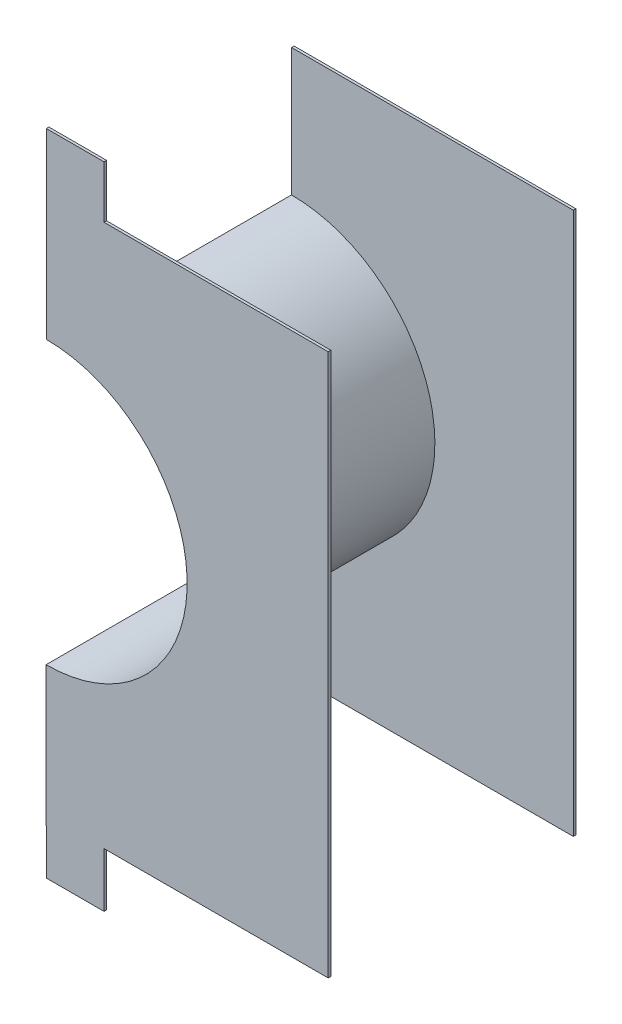
ISO-10303-21;
HEADER;
FILE_DESCRIPTION(('STEP AP214'),'2;1');
FILE_NAME('part.step','',(''),(''),'','','');
FILE_SCHEMA(('AUTOMOTIVE_DESIGN { 1 0 10303 214 1 1 1 1 }'));
ENDSEC;
DATA;
#1=APPLICATION_CONTEXT('core data for automotive mechanical design processes');
#2=APPLICATION_PROTOCOL_DEFINITION('international standard','automotive_design',2000,#1);
#3=PRODUCT_CONTEXT('',#1,'mechanical');
#4=PRODUCT('Part','Part','',(#3));
#5=PRODUCT_RELATED_PRODUCT_CATEGORY('part','',(#4));
#6=PRODUCT_DEFINITION_FORMATION('','',#4);
#7=PRODUCT_DEFINITION_CONTEXT('part definition',#1,'design');
#8=PRODUCT_DEFINITION('design','',#6,#7);
#9=PRODUCT_DEFINITION_SHAPE('','',#8);
#10=(LENGTH_UNIT() NAMED_UNIT(*) SI_UNIT(.MILLI.,.METRE.));
#11=(NAMED_UNIT(*) PLANE_ANGLE_UNIT() SI_UNIT($,.RADIAN.));
#12=(NAMED_UNIT(*) SI_UNIT($,.STERADIAN.) SOLID_ANGLE_UNIT());
#13=UNCERTAINTY_MEASURE_WITH_UNIT(LENGTH_MEASURE(1.E-05),#10,'distance_accuracy_value','');
#14=(GEOMETRIC_REPRESENTATION_CONTEXT(3) GLOBAL_UNCERTAINTY_ASSIGNED_CONTEXT((#13)) GLOBAL_UNIT_ASSIGNED_CONTEXT((#10,
#11,#12)) REPRESENTATION_CONTEXT('',''));
#15=CARTESIAN_POINT('',(0.,0.,0.));
#16=DIRECTION('',(0.,0.,1.));
#17=DIRECTION('',(1.,0.,0.));
#18=AXIS2_PLACEMENT_3D('',#15,#16,#17);
#19=CARTESIAN_POINT('',(0.330340345843,-0.760783826789,0.));
#20=DIRECTION('',(-1.,0.,0.));
#21=DIRECTION('',(0.,0.,1.));
#22=AXIS2_PLACEMENT_3D('',#19,#20,#21);
#23=PLANE('',#22);
#24=DIRECTION('',(0.,1.,0.));
#25=VECTOR('',#24,1.);
#26=CARTESIAN_POINT('',(0.330340345843,-0.001069787476899,-0.574));
#27=LINE('',#26,#25);
#28=CARTESIAN_POINT('',(0.330340345843,-0.635,-0.574));
#29=VERTEX_POINT('',#28);
#30=CARTESIAN_POINT('',(0.330340345843,0.635,-0.574));
#31=VERTEX_POINT('',#30);
#32=EDGE_CURVE('E295',#29,#31,#27,.T.);
#33=ORIENTED_EDGE('',*,*,#32,.F.);
#34=DIRECTION('',(0.,0.,1.));
#35=VECTOR('',#34,1.);
#36=CARTESIAN_POINT('',(0.330340345843,-0.635,-0.58));
#37=LINE('',#36,#35);
#38=CARTESIAN_POINT('',(0.330340345843,-0.635,-0.58));
#39=VERTEX_POINT('',#38);
#40=EDGE_CURVE('E412',#29,#39,#37,.F.);
#41=ORIENTED_EDGE('',*,*,#40,.T.);
#42=DIRECTION('',(0.,1.,0.));
#43=VECTOR('',#42,1.);
#44=CARTESIAN_POINT('',(0.330340345843,-0.001069787476899,-0.58));
#45=LINE('',#44,#43);
#46=CARTESIAN_POINT('',(0.330340345843,0.635,-0.58));
#47=VERTEX_POINT('',#46);
#48=EDGE_CURVE('E397',#39,#47,#45,.T.);
#49=ORIENTED_EDGE('',*,*,#48,.T.);
#50=DIRECTION('',(0.,0.,-1.));
#51=VECTOR('',#50,1.);
#52=CARTESIAN_POINT('',(0.330340345843,0.635,-0.58));
#53=LINE('',#52,#51);
#54=EDGE_CURVE('E419',#47,#31,#53,.F.);
#55=ORIENTED_EDGE('',*,*,#54,.T.);
#56=EDGE_LOOP('',(#33,#41,#49,#55));
#57=FACE_BOUND('',#56,.T.);
#58=ADVANCED_FACE('F17',(#57),#23,.F.);
#59=CARTESIAN_POINT('',(-0.330340345843,0.635,-0.58));
#60=DIRECTION('',(0.,-1.,0.));
#61=DIRECTION('',(0.,0.,-1.));
#62=AXIS2_PLACEMENT_3D('',#59,#60,#61);
#63=PLANE('',#62);
#64=DIRECTION('',(1.,0.,0.));
#65=VECTOR('',#64,1.);
#66=CARTESIAN_POINT('',(0.02781893329865,0.635,-0.574));
#67=LINE('',#66,#65);
#68=CARTESIAN_POINT('',(-0.329659654157,0.635,-0.574));
#69=VERTEX_POINT('',#68);
#70=EDGE_CURVE('E392',#31,#69,#67,.F.);
#71=ORIENTED_EDGE('',*,*,#70,.F.);
#72=ORIENTED_EDGE('',*,*,#54,.F.);
#73=DIRECTION('',(1.,0.,0.));
#74=VECTOR('',#73,1.);
#75=CARTESIAN_POINT('',(0.02781893329865,0.635,-0.58));
#76=LINE('',#75,#74);
#77=CARTESIAN_POINT('',(-0.329659654157,0.635,-0.58));
#78=VERTEX_POINT('',#77);
#79=EDGE_CURVE('E393',#47,#78,#76,.F.);
#80=ORIENTED_EDGE('',*,*,#79,.T.);
#81=DIRECTION('',(0.,0.,-1.));
#82=VECTOR('',#81,1.);
#83=CARTESIAN_POINT('',(-0.329659654157,0.635,0.));
#84=LINE('',#83,#82);
#85=EDGE_CURVE('E444',#78,#69,#84,.F.);
#86=ORIENTED_EDGE('',*,*,#85,.T.);
#87=EDGE_LOOP('',(#71,#72,#80,#86));
#88=FACE_BOUND('',#87,.T.);
#89=ADVANCED_FACE('F324',(#88),#63,.F.);
#90=CARTESIAN_POINT('',(0.330340345843,-0.635,-0.58));
#91=DIRECTION('',(0.,1.,0.));
#92=DIRECTION('',(0.,0.,1.));
#93=AXIS2_PLACEMENT_3D('',#90,#91,#92);
#94=PLANE('',#93);
#95=DIRECTION('',(0.,0.,-1.));
#96=VECTOR('',#95,1.);
#97=CARTESIAN_POINT('',(-0.330340345843,-0.635,-0.58));
#98=LINE('',#97,#96);
#99=CARTESIAN_POINT('',(-0.330340345843,-0.635,-0.574));
#100=VERTEX_POINT('',#99);
#101=CARTESIAN_POINT('',(-0.330340345843,-0.635,-0.58));
#102=VERTEX_POINT('',#101);
#103=EDGE_CURVE('E193',#100,#102,#98,.T.);
#104=ORIENTED_EDGE('',*,*,#103,.T.);
#105=DIRECTION('',(1.,0.,0.));
#106=VECTOR('',#105,1.);
#107=CARTESIAN_POINT('',(0.02781893329865,-0.635,-0.58));
#108=LINE('',#107,#106);
#109=EDGE_CURVE('E311',#102,#39,#108,.T.);
#110=ORIENTED_EDGE('',*,*,#109,.T.);
#111=ORIENTED_EDGE('',*,*,#40,.F.);
#112=DIRECTION('',(1.,0.,0.));
#113=VECTOR('',#112,1.);
#114=CARTESIAN_POINT('',(0.02781893329865,-0.635,-0.574));
#115=LINE('',#114,#113);
#116=EDGE_CURVE('E292',#100,#29,#115,.T.);
#117=ORIENTED_EDGE('',*,*,#116,.F.);
#118=EDGE_LOOP('',(#104,#110,#111,#117));
#119=FACE_BOUND('',#118,.T.);
#120=ADVANCED_FACE('F322',(#119),#94,.F.);
#121=CARTESIAN_POINT('',(0.02781893329865,-0.001069787476899,-0.58));
#122=DIRECTION('',(0.,0.,1.));
#123=DIRECTION('',(1.,0.,0.));
#124=AXIS2_PLACEMENT_3D('',#121,#122,#123);
#125=PLANE('',#124);
#126=ORIENTED_EDGE('',*,*,#48,.F.);
#127=ORIENTED_EDGE('',*,*,#109,.F.);
#128=DIRECTION('',(0.,1.,0.));
#129=VECTOR('',#128,1.);
#130=CARTESIAN_POINT('',(-0.330340345843,-0.635,-0.58));
#131=LINE('',#130,#129);
#132=CARTESIAN_POINT('',(-0.330340345843,-0.329999824491983,-0.58));
#133=VERTEX_POINT('',#132);
#134=EDGE_CURVE('E151',#102,#133,#131,.T.);
#135=ORIENTED_EDGE('',*,*,#134,.T.);
#136=CARTESIAN_POINT('',(-0.330340345843,-0.329999824492,-0.58));
#137=CARTESIAN_POINT('',(-0.26712841051764,-0.33006501822186,-0.58));
#138=CARTESIAN_POINT('',(-0.208845260031309,-0.306955255669527,-0.58));
#139=CARTESIAN_POINT('',(-0.144821469592758,-0.281569280779884,-0.58));
#140=CARTESIAN_POINT('',(-0.0968955471649169,-0.23358577454217,-0.58));
#141=CARTESIAN_POINT('',(-0.0482248819428217,-0.184856630689084,-0.58));
#142=CARTESIAN_POINT('',(-0.0232953033389743,-0.121787639134969,-0.58));
#143=CARTESIAN_POINT('',(3.58282880240539E-05,-0.062762536187419,-0.58));
#144=CARTESIAN_POINT('',(-1.75508066142371E-07,-0.000340345842999733,-0.58));
#145=CARTESIAN_POINT('',(-3.67828967418281E-05,0.0631283333540779,-0.58));
#146=CARTESIAN_POINT('',(-0.0230447443305151,0.121154739968696,-0.58));
#147=CARTESIAN_POINT('',(-0.0484307192201517,0.185178530407263,-0.58));
#148=CARTESIAN_POINT('',(-0.0964142254578492,0.233104452835103,-0.58));
#149=CARTESIAN_POINT('',(-0.145143369310935,0.281775118057213,-0.58));
#150=CARTESIAN_POINT('',(-0.208212360865036,0.306704696661068,-0.58));
#151=CARTESIAN_POINT('',(-0.266982841853826,0.329935182662093,-0.58));
#152=CARTESIAN_POINT('',(-0.329659654157,0.329999824492,-0.58));
#153=B_SPLINE_CURVE_WITH_KNOTS('',2,(#136,#137,#138,#139,#140,#141,#142,#143,#144,#145,#146,
#147,#148,#149,#150,#151,#152),.UNSPECIFIED.,.F.,.F.,(3,2,2,2,2,2,2,2,3),(0.,0.125,0.25,0.375,
0.5,0.625,0.75,0.875,1.),.UNSPECIFIED.);
#154=CARTESIAN_POINT('',(-0.329659654157,0.32999982449195,-0.58));
#155=VERTEX_POINT('',#154);
#156=EDGE_CURVE('E146',#133,#155,#153,.T.);
#157=ORIENTED_EDGE('',*,*,#156,.T.);
#158=DIRECTION('',(0.,1.,0.));
#159=VECTOR('',#158,1.);
#160=CARTESIAN_POINT('',(-0.329659654157,0.759216173211,-0.58));
#161=LINE('',#160,#159);
#162=EDGE_CURVE('E198',#155,#78,#161,.T.);
#163=ORIENTED_EDGE('',*,*,#162,.T.);
#164=ORIENTED_EDGE('',*,*,#79,.F.);
#165=EDGE_LOOP('',(#126,#127,#135,#157,#163,#164));
#166=FACE_BOUND('',#165,.T.);
#167=ADVANCED_FACE('F313',(#166),#125,.F.);
#168=CARTESIAN_POINT('',(-0.33,0.,0.));
#169=DIRECTION('',(0.,0.,1.));
#170=DIRECTION('',(1.,0.,0.));
#171=AXIS2_PLACEMENT_3D('',#168,#169,#170);
#172=CYLINDRICAL_SURFACE('',#171,0.336);
#173=DIRECTION('',(0.,0.,-1.));
#174=VECTOR('',#173,1.);
#175=CARTESIAN_POINT('',(-0.329659654157,0.335999827664,0.));
#176=LINE('',#175,#174);
#177=CARTESIAN_POINT('',(-0.32965965415701,0.335999827649753,-0.574));
#178=VERTEX_POINT('',#177);
#179=CARTESIAN_POINT('',(-0.32965965415701,0.335999827654502,-0.006));
#180=VERTEX_POINT('',#179);
#181=EDGE_CURVE('E447',#178,#180,#176,.F.);
#182=ORIENTED_EDGE('',*,*,#181,.T.);
#183=CARTESIAN_POINT('',(-0.33,0.,-0.006));
#184=DIRECTION('',(0.,0.,-1.));
#185=DIRECTION('',(0.00101293405643372,0.999999486982167,0.));
#186=AXIS2_PLACEMENT_3D('',#183,#184,#185);
#187=CIRCLE('',#186,0.336);
#188=CARTESIAN_POINT('',(-0.330340345843,-0.335999827626002,-0.00600000000000002));
#189=VERTEX_POINT('',#188);
#190=EDGE_CURVE('E232',#180,#189,#187,.T.);
#191=ORIENTED_EDGE('',*,*,#190,.T.);
#192=DIRECTION('',(0.,0.,-1.));
#193=VECTOR('',#192,1.);
#194=CARTESIAN_POINT('',(-0.330340345843,-0.335999827626,-0.58));
#195=LINE('',#194,#193);
#196=CARTESIAN_POINT('',(-0.330340345843,-0.335999827626002,-0.574));
#197=VERTEX_POINT('',#196);
#198=EDGE_CURVE('E278',#189,#197,#195,.T.);
#199=ORIENTED_EDGE('',*,*,#198,.T.);
#200=CARTESIAN_POINT('',(-0.329659654157,0.335999827664,-0.574));
#201=CARTESIAN_POINT('',(-0.26583836238212,0.335935180863654,-0.574));
#202=CARTESIAN_POINT('',(-0.206003791454036,0.312283429405446,-0.574));
#203=CARTESIAN_POINT('',(-0.141779403355028,0.286896445905572,-0.574));
#204=CARTESIAN_POINT('',(-0.0921715825546136,0.237347095749475,-0.574));
#205=CARTESIAN_POINT('',(-0.0433093913833842,0.188542496380394,-0.574));
#206=CARTESIAN_POINT('',(-0.0174660116101208,0.123363309382388,-0.574));
#207=CARTESIAN_POINT('',(0.00596322683989083,0.0642727907446489,-0.574));
#208=CARTESIAN_POINT('',(0.00599982762600817,-0.000340345842980596,-0.574));
#209=CARTESIAN_POINT('',(0.00603583562097266,-0.0639069995598871,-0.574));
#210=CARTESIAN_POINT('',(-0.0177165706185686,-0.123996208545957,-0.574));
#211=CARTESIAN_POINT('',(-0.0431035541111863,-0.188220596644974,-0.574));
#212=CARTESIAN_POINT('',(-0.0926529042616657,-0.237828417445386,-0.574));
#213=CARTESIAN_POINT('',(-0.141457503625223,-0.286690608616623,-0.574));
#214=CARTESIAN_POINT('',(-0.206636690620298,-0.312533988389879,-0.574));
#215=CARTESIAN_POINT('',(-0.265983931285183,-0.336065016463508,-0.574));
#216=CARTESIAN_POINT('',(-0.330340345843,-0.335999827626,-0.574));
#217=B_SPLINE_CURVE_WITH_KNOTS('',2,(#200,#201,#202,#203,#204,#205,#206,#207,#208,#209,#210,
#211,#212,#213,#214,#215,#216),.UNSPECIFIED.,.F.,.F.,(3,2,2,2,2,2,2,2,3),(0.,0.125,0.25,0.375,
0.5,0.625,0.75,0.875,1.),.UNSPECIFIED.);
#218=EDGE_CURVE('E296',#178,#197,#217,.T.);
#219=ORIENTED_EDGE('',*,*,#218,.F.);
#220=EDGE_LOOP('',(#182,#191,#199,#219));
#221=FACE_BOUND('',#220,.T.);
#222=ADVANCED_FACE('F267',(#221),#172,.T.);
#223=CARTESIAN_POINT('',(0.02781893329865,-0.001069787476899,-0.574));
#224=DIRECTION('',(0.,0.,1.));
#225=DIRECTION('',(1.,0.,0.));
#226=AXIS2_PLACEMENT_3D('',#223,#224,#225);
#227=PLANE('',#226);
#228=ORIENTED_EDGE('',*,*,#116,.T.);
#229=ORIENTED_EDGE('',*,*,#32,.T.);
#230=ORIENTED_EDGE('',*,*,#70,.T.);
#231=DIRECTION('',(0.,1.,0.));
#232=VECTOR('',#231,1.);
#233=CARTESIAN_POINT('',(-0.329659654157,0.759216173211,-0.574));
#234=LINE('',#233,#232);
#235=EDGE_CURVE('E390',#69,#178,#234,.F.);
#236=ORIENTED_EDGE('',*,*,#235,.T.);
#237=ORIENTED_EDGE('',*,*,#218,.T.);
#238=DIRECTION('',(0.,1.,0.));
#239=VECTOR('',#238,1.);
#240=CARTESIAN_POINT('',(-0.330340345843,-0.635,-0.574));
#241=LINE('',#240,#239);
#242=EDGE_CURVE('E285',#197,#100,#241,.F.);
#243=ORIENTED_EDGE('',*,*,#242,.T.);
#244=EDGE_LOOP('',(#228,#229,#230,#236,#237,#243));
#245=FACE_BOUND('',#244,.T.);
#246=ADVANCED_FACE('F262',(#245),#227,.T.);
#247=CARTESIAN_POINT('',(0.02781893329865,-0.001069787476899,-0.006));
#248=DIRECTION('',(0.,0.,1.));
#249=DIRECTION('',(1.,0.,0.));
#250=AXIS2_PLACEMENT_3D('',#247,#248,#249);
#251=PLANE('',#250);
#252=DIRECTION('',(0.,1.,0.));
#253=VECTOR('',#252,1.);
#254=CARTESIAN_POINT('',(0.330340345843,-0.760783826789,-0.006));
#255=LINE('',#254,#253);
#256=CARTESIAN_POINT('',(0.330340345843,0.635,-0.00600000000000001));
#257=VERTEX_POINT('',#256);
#258=CARTESIAN_POINT('',(0.330340345843,-0.635,-0.00600000000000001));
#259=VERTEX_POINT('',#258);
#260=EDGE_CURVE('E235',#257,#259,#255,.F.);
#261=ORIENTED_EDGE('',*,*,#260,.T.);
#262=DIRECTION('',(1.,0.,0.));
#263=VECTOR('',#262,1.);
#264=CARTESIAN_POINT('',(0.330340345843,-0.635,-0.00600000000000004));
#265=LINE('',#264,#263);
#266=CARTESIAN_POINT('',(-0.194599178732,-0.635,-0.00600000000000002));
#267=VERTEX_POINT('',#266);
#268=EDGE_CURVE('E249',#259,#267,#265,.F.);
#269=ORIENTED_EDGE('',*,*,#268,.T.);
#270=DIRECTION('',(0.,1.,0.));
#271=VECTOR('',#270,1.);
#272=CARTESIAN_POINT('',(-0.194599178732,-0.762439620436,-0.006));
#273=LINE('',#272,#271);
#274=CARTESIAN_POINT('',(-0.194599178732,-0.762439620436,-0.006));
#275=VERTEX_POINT('',#274);
#276=EDGE_CURVE('E497',#267,#275,#273,.F.);
#277=ORIENTED_EDGE('',*,*,#276,.T.);
#278=DIRECTION('',(1.,0.,0.));
#279=VECTOR('',#278,1.);
#280=CARTESIAN_POINT('',(-0.329659654157,-0.762439620436,-0.006));
#281=LINE('',#280,#279);
#282=CARTESIAN_POINT('',(-0.329659654157,-0.762439620436,-0.006));
#283=VERTEX_POINT('',#282);
#284=EDGE_CURVE('E186',#275,#283,#281,.F.);
#285=ORIENTED_EDGE('',*,*,#284,.T.);
#286=DIRECTION('',(0.,1.,0.));
#287=VECTOR('',#286,1.);
#288=CARTESIAN_POINT('',(-0.329659654157,-0.635,-0.006));
#289=LINE('',#288,#287);
#290=CARTESIAN_POINT('',(-0.33,-0.635,-0.00600000000000002));
#291=VERTEX_POINT('',#290);
#292=EDGE_CURVE('E187',#283,#291,#289,.T.);
#293=ORIENTED_EDGE('',*,*,#292,.T.);
#294=DIRECTION('',(0.,1.,0.));
#295=VECTOR('',#294,1.);
#296=CARTESIAN_POINT('',(-0.330340345843,-0.635,-0.00600000000000004));
#297=LINE('',#296,#295);
#298=EDGE_CURVE('E150',#291,#189,#297,.T.);
#299=ORIENTED_EDGE('',*,*,#298,.T.);
#300=ORIENTED_EDGE('',*,*,#190,.F.);
#301=DIRECTION('',(0.,1.,0.));
#302=VECTOR('',#301,1.);
#303=CARTESIAN_POINT('',(-0.329659654157,0.759216173211,-0.006));
#304=LINE('',#303,#302);
#305=CARTESIAN_POINT('',(-0.329659654157,0.757662112361,-0.006));
#306=VERTEX_POINT('',#305);
#307=EDGE_CURVE('E199',#180,#306,#304,.T.);
#308=ORIENTED_EDGE('',*,*,#307,.T.);
#309=DIRECTION('',(1.,0.,0.));
#310=VECTOR('',#309,1.);
#311=CARTESIAN_POINT('',(-0.194599178732,0.757662112361,-0.006));
#312=LINE('',#311,#310);
#313=CARTESIAN_POINT('',(-0.194599178732,0.757662112361,-0.006));
#314=VERTEX_POINT('',#313);
#315=EDGE_CURVE('E206',#306,#314,#312,.T.);
#316=ORIENTED_EDGE('',*,*,#315,.T.);
#317=DIRECTION('',(0.,1.,0.));
#318=VECTOR('',#317,1.);
#319=CARTESIAN_POINT('',(-0.194599178732,0.635,-0.006));
#320=LINE('',#319,#318);
#321=CARTESIAN_POINT('',(-0.194599178732,0.635,-0.00600000000000001));
#322=VERTEX_POINT('',#321);
#323=EDGE_CURVE('E207',#314,#322,#320,.F.);
#324=ORIENTED_EDGE('',*,*,#323,.T.);
#325=DIRECTION('',(1.,0.,0.));
#326=VECTOR('',#325,1.);
#327=CARTESIAN_POINT('',(-0.330340345843,0.635,-0.00600000000000004));
#328=LINE('',#327,#326);
#329=EDGE_CURVE('E217',#322,#257,#328,.T.);
#330=ORIENTED_EDGE('',*,*,#329,.T.);
#331=EDGE_LOOP('',(#261,#269,#277,#285,#293,#299,#300,#308,#316,#324,#330));
#332=FACE_BOUND('',#331,.T.);
#333=ADVANCED_FACE('F251',(#332),#251,.F.);
#334=CARTESIAN_POINT('',(-0.330340345843,0.635,-0.58));
#335=DIRECTION('',(0.,-1.,0.));
#336=DIRECTION('',(0.,0.,-1.));
#337=AXIS2_PLACEMENT_3D('',#334,#335,#336);
#338=PLANE('',#337);
#339=DIRECTION('',(1.,0.,0.));
#340=VECTOR('',#339,1.);
#341=CARTESIAN_POINT('',(0.02781893329865,0.635,0.));
#342=LINE('',#341,#340);
#343=CARTESIAN_POINT('',(0.330340345843,0.635,0.));
#344=VERTEX_POINT('',#343);
#345=CARTESIAN_POINT('',(-0.194599178732,0.635,0.));
#346=VERTEX_POINT('',#345);
#347=EDGE_CURVE('E212',#344,#346,#342,.F.);
#348=ORIENTED_EDGE('',*,*,#347,.F.);
#349=DIRECTION('',(0.,0.,1.));
#350=VECTOR('',#349,1.);
#351=CARTESIAN_POINT('',(0.330340345843,0.635,0.));
#352=LINE('',#351,#350);
#353=EDGE_CURVE('E222',#344,#257,#352,.F.);
#354=ORIENTED_EDGE('',*,*,#353,.T.);
#355=ORIENTED_EDGE('',*,*,#329,.F.);
#356=DIRECTION('',(0.,0.,1.));
#357=VECTOR('',#356,1.);
#358=CARTESIAN_POINT('',(-0.194599178732,0.635,0.));
#359=LINE('',#358,#357);
#360=EDGE_CURVE('E215',#322,#346,#359,.T.);
#361=ORIENTED_EDGE('',*,*,#360,.T.);
#362=EDGE_LOOP('',(#348,#354,#355,#361));
#363=FACE_BOUND('',#362,.T.);
#364=ADVANCED_FACE('F261',(#363),#338,.F.);
#365=CARTESIAN_POINT('',(-0.194599178732,0.635,0.));
#366=DIRECTION('',(-1.,0.,0.));
#367=DIRECTION('',(0.,0.,1.));
#368=AXIS2_PLACEMENT_3D('',#365,#366,#367);
#369=PLANE('',#368);
#370=DIRECTION('',(0.,0.,-1.));
#371=VECTOR('',#370,1.);
#372=CARTESIAN_POINT('',(-0.194599178732,0.757662112361,0.));
#373=LINE('',#372,#371);
#374=CARTESIAN_POINT('',(-0.194599178732,0.757662112361,0.));
#375=VERTEX_POINT('',#374);
#376=EDGE_CURVE('E204',#314,#375,#373,.F.);
#377=ORIENTED_EDGE('',*,*,#376,.T.);
#378=DIRECTION('',(0.,1.,0.));
#379=VECTOR('',#378,1.);
#380=CARTESIAN_POINT('',(-0.194599178732,-0.001069787476899,0.));
#381=LINE('',#380,#379);
#382=EDGE_CURVE('E171',#346,#375,#381,.T.);
#383=ORIENTED_EDGE('',*,*,#382,.F.);
#384=ORIENTED_EDGE('',*,*,#360,.F.);
#385=ORIENTED_EDGE('',*,*,#323,.F.);
#386=EDGE_LOOP('',(#377,#383,#384,#385));
#387=FACE_BOUND('',#386,.T.);
#388=ADVANCED_FACE('F478',(#387),#369,.F.);
#389=CARTESIAN_POINT('',(-0.194599178732,0.757662112361,0.));
#390=DIRECTION('',(0.,-1.,0.));
#391=DIRECTION('',(0.,0.,-1.));
#392=AXIS2_PLACEMENT_3D('',#389,#390,#391);
#393=PLANE('',#392);
#394=DIRECTION('',(0.,0.,-1.));
#395=VECTOR('',#394,1.);
#396=CARTESIAN_POINT('',(-0.329659654157,0.757662112361,0.));
#397=LINE('',#396,#395);
#398=CARTESIAN_POINT('',(-0.329659654157,0.757662112361,0.));
#399=VERTEX_POINT('',#398);
#400=EDGE_CURVE('E196',#306,#399,#397,.F.);
#401=ORIENTED_EDGE('',*,*,#400,.T.);
#402=DIRECTION('',(1.,0.,0.));
#403=VECTOR('',#402,1.);
#404=CARTESIAN_POINT('',(0.02781893329865,0.757662112361,0.));
#405=LINE('',#404,#403);
#406=EDGE_CURVE('E169',#375,#399,#405,.F.);
#407=ORIENTED_EDGE('',*,*,#406,.F.);
#408=ORIENTED_EDGE('',*,*,#376,.F.);
#409=ORIENTED_EDGE('',*,*,#315,.F.);
#410=EDGE_LOOP('',(#401,#407,#408,#409));
#411=FACE_BOUND('',#410,.T.);
#412=ADVANCED_FACE('F476',(#411),#393,.F.);
#413=CARTESIAN_POINT('',(-0.329659654157,0.759216173211,0.));
#414=DIRECTION('',(1.,0.,0.));
#415=DIRECTION('',(0.,0.,-1.));
#416=AXIS2_PLACEMENT_3D('',#413,#414,#415);
#417=PLANE('',#416);
#418=ORIENTED_EDGE('',*,*,#162,.F.);
#419=DIRECTION('',(0.,0.,1.));
#420=VECTOR('',#419,1.);
#421=CARTESIAN_POINT('',(-0.329659654157,0.329999824491934,0.));
#422=LINE('',#421,#420);
#423=CARTESIAN_POINT('',(-0.329659654157,0.329999824491934,0.));
#424=VERTEX_POINT('',#423);
#425=EDGE_CURVE('E135',#155,#424,#422,.T.);
#426=ORIENTED_EDGE('',*,*,#425,.T.);
#427=DIRECTION('',(0.,1.,0.));
#428=VECTOR('',#427,1.);
#429=CARTESIAN_POINT('',(-0.329659654157,-0.001069787476899,0.));
#430=LINE('',#429,#428);
#431=EDGE_CURVE('E168',#399,#424,#430,.F.);
#432=ORIENTED_EDGE('',*,*,#431,.F.);
#433=ORIENTED_EDGE('',*,*,#400,.F.);
#434=ORIENTED_EDGE('',*,*,#307,.F.);
#435=ORIENTED_EDGE('',*,*,#181,.F.);
#436=ORIENTED_EDGE('',*,*,#235,.F.);
#437=ORIENTED_EDGE('',*,*,#85,.F.);
#438=EDGE_LOOP('',(#418,#426,#432,#433,#434,#435,#436,#437));
#439=FACE_BOUND('',#438,.T.);
#440=ADVANCED_FACE('F446',(#439),#417,.F.);
#441=CARTESIAN_POINT('',(-0.33,0.,0.));
#442=DIRECTION('',(0.,0.,1.));
#443=DIRECTION('',(1.,0.,0.));
#444=AXIS2_PLACEMENT_3D('',#441,#442,#443);
#445=CYLINDRICAL_SURFACE('',#444,0.33);
#446=CARTESIAN_POINT('',(-0.33,0.,0.));
#447=DIRECTION('',(0.,0.,1.));
#448=DIRECTION('',(1.,0.,0.));
#449=AXIS2_PLACEMENT_3D('',#446,#447,#448);
#450=CIRCLE('',#449,0.33);
#451=CARTESIAN_POINT('',(-0.330340345843,-0.329999824491967,0.));
#452=VERTEX_POINT('',#451);
#453=EDGE_CURVE('E20',#424,#452,#450,.F.);
#454=ORIENTED_EDGE('',*,*,#453,.F.);
#455=ORIENTED_EDGE('',*,*,#425,.F.);
#456=ORIENTED_EDGE('',*,*,#156,.F.);
#457=DIRECTION('',(0.,0.,-1.));
#458=VECTOR('',#457,1.);
#459=CARTESIAN_POINT('',(-0.330340345843,-0.329999824492,-0.58));
#460=LINE('',#459,#458);
#461=EDGE_CURVE('E141',#133,#452,#460,.F.);
#462=ORIENTED_EDGE('',*,*,#461,.T.);
#463=EDGE_LOOP('',(#454,#455,#456,#462));
#464=FACE_BOUND('',#463,.T.);
#465=ADVANCED_FACE('F143',(#464),#445,.F.);
#466=CARTESIAN_POINT('',(-0.330340345843,-0.635,-0.58));
#467=DIRECTION('',(1.,0.,0.));
#468=DIRECTION('',(0.,0.,-1.));
#469=AXIS2_PLACEMENT_3D('',#466,#467,#468);
#470=PLANE('',#469);
#471=ORIENTED_EDGE('',*,*,#198,.F.);
#472=ORIENTED_EDGE('',*,*,#298,.F.);
#473=CARTESIAN_POINT('',(-0.330340345843,-0.635,-0.00600000000000004));
#474=DIRECTION('',(0.,0.,1.));
#475=VECTOR('',#474,1.);
#476=LINE('',#473,#475);
#477=CARTESIAN_POINT('',(-0.33,-0.635,0.));
#478=VERTEX_POINT('',#477);
#479=EDGE_CURVE('E158',#291,#478,#476,.T.);
#480=ORIENTED_EDGE('',*,*,#479,.T.);
#481=DIRECTION('',(0.,1.,0.));
#482=VECTOR('',#481,1.);
#483=CARTESIAN_POINT('',(-0.330340345843,-0.001069787476899,0.));
#484=LINE('',#483,#482);
#485=EDGE_CURVE('E154',#452,#478,#484,.F.);
#486=ORIENTED_EDGE('',*,*,#485,.F.);
#487=ORIENTED_EDGE('',*,*,#461,.F.);
#488=ORIENTED_EDGE('',*,*,#134,.F.);
#489=ORIENTED_EDGE('',*,*,#103,.F.);
#490=ORIENTED_EDGE('',*,*,#242,.F.);
#491=EDGE_LOOP('',(#471,#472,#480,#486,#487,#488,#489,#490));
#492=FACE_BOUND('',#491,.T.);
#493=ADVANCED_FACE('F156',(#492),#470,.F.);
#494=CARTESIAN_POINT('',(-0.329659654157,-0.635,0.));
#495=DIRECTION('',(1.,0.,0.));
#496=DIRECTION('',(0.,0.,-1.));
#497=AXIS2_PLACEMENT_3D('',#494,#495,#496);
#498=PLANE('',#497);
#499=DIRECTION('',(0.,0.,1.));
#500=VECTOR('',#499,1.);
#501=CARTESIAN_POINT('',(-0.329659654157,-0.762439620436,0.));
#502=LINE('',#501,#500);
#503=CARTESIAN_POINT('',(-0.329659654157,-0.762439620436,0.));
#504=VERTEX_POINT('',#503);
#505=EDGE_CURVE('E184',#283,#504,#502,.T.);
#506=ORIENTED_EDGE('',*,*,#505,.T.);
#507=DIRECTION('',(0.,1.,0.));
#508=VECTOR('',#507,1.);
#509=CARTESIAN_POINT('',(-0.329659654157,-0.001069787476899,0.));
#510=LINE('',#509,#508);
#511=EDGE_CURVE('E163',#478,#504,#510,.F.);
#512=ORIENTED_EDGE('',*,*,#511,.F.);
#513=ORIENTED_EDGE('',*,*,#479,.F.);
#514=ORIENTED_EDGE('',*,*,#292,.F.);
#515=EDGE_LOOP('',(#506,#512,#513,#514));
#516=FACE_BOUND('',#515,.T.);
#517=ADVANCED_FACE('F353',(#516),#498,.F.);
#518=CARTESIAN_POINT('',(-0.329659654157,-0.762439620436,0.));
#519=DIRECTION('',(0.,1.,0.));
#520=DIRECTION('',(0.,0.,1.));
#521=AXIS2_PLACEMENT_3D('',#518,#519,#520);
#522=PLANE('',#521);
#523=DIRECTION('',(0.,0.,1.));
#524=VECTOR('',#523,1.);
#525=CARTESIAN_POINT('',(-0.194599178732,-0.762439620436,0.));
#526=LINE('',#525,#524);
#527=CARTESIAN_POINT('',(-0.194599178732,-0.762439620436,0.));
#528=VERTEX_POINT('',#527);
#529=EDGE_CURVE('E499',#275,#528,#526,.T.);
#530=ORIENTED_EDGE('',*,*,#529,.T.);
#531=DIRECTION('',(1.,0.,0.));
#532=VECTOR('',#531,1.);
#533=CARTESIAN_POINT('',(0.02781893329865,-0.762439620436,0.));
#534=LINE('',#533,#532);
#535=EDGE_CURVE('E178',#504,#528,#534,.T.);
#536=ORIENTED_EDGE('',*,*,#535,.F.);
#537=ORIENTED_EDGE('',*,*,#505,.F.);
#538=ORIENTED_EDGE('',*,*,#284,.F.);
#539=EDGE_LOOP('',(#530,#536,#537,#538));
#540=FACE_BOUND('',#539,.T.);
#541=ADVANCED_FACE('F349',(#540),#522,.F.);
#542=CARTESIAN_POINT('',(-0.194599178732,-0.762439620436,0.));
#543=DIRECTION('',(-1.,0.,0.));
#544=DIRECTION('',(0.,0.,1.));
#545=AXIS2_PLACEMENT_3D('',#542,#543,#544);
#546=PLANE('',#545);
#547=DIRECTION('',(0.,0.,1.));
#548=VECTOR('',#547,1.);
#549=CARTESIAN_POINT('',(-0.194599178732,-0.635,-0.58));
#550=LINE('',#549,#548);
#551=CARTESIAN_POINT('',(-0.194599178732,-0.635,0.));
#552=VERTEX_POINT('',#551);
#553=EDGE_CURVE('E237',#267,#552,#550,.T.);
#554=ORIENTED_EDGE('',*,*,#553,.T.);
#555=DIRECTION('',(0.,1.,0.));
#556=VECTOR('',#555,1.);
#557=CARTESIAN_POINT('',(-0.194599178732,-0.001069787476899,0.));
#558=LINE('',#557,#556);
#559=EDGE_CURVE('E181',#528,#552,#558,.T.);
#560=ORIENTED_EDGE('',*,*,#559,.F.);
#561=ORIENTED_EDGE('',*,*,#529,.F.);
#562=ORIENTED_EDGE('',*,*,#276,.F.);
#563=EDGE_LOOP('',(#554,#560,#561,#562));
#564=FACE_BOUND('',#563,.T.);
#565=ADVANCED_FACE('F346',(#564),#546,.F.);
#566=CARTESIAN_POINT('',(0.330340345843,-0.635,-0.58));
#567=DIRECTION('',(0.,1.,0.));
#568=DIRECTION('',(0.,0.,1.));
#569=AXIS2_PLACEMENT_3D('',#566,#567,#568);
#570=PLANE('',#569);
#571=ORIENTED_EDGE('',*,*,#268,.F.);
#572=DIRECTION('',(0.,0.,1.));
#573=VECTOR('',#572,1.);
#574=CARTESIAN_POINT('',(0.330340345843,-0.635,0.));
#575=LINE('',#574,#573);
#576=CARTESIAN_POINT('',(0.330340345843,-0.635,0.));
#577=VERTEX_POINT('',#576);
#578=EDGE_CURVE('E35',#259,#577,#575,.T.);
#579=ORIENTED_EDGE('',*,*,#578,.T.);
#580=DIRECTION('',(1.,0.,0.));
#581=VECTOR('',#580,1.);
#582=CARTESIAN_POINT('',(0.02781893329865,-0.635,0.));
#583=LINE('',#582,#581);
#584=EDGE_CURVE('E26',#552,#577,#583,.T.);
#585=ORIENTED_EDGE('',*,*,#584,.F.);
#586=ORIENTED_EDGE('',*,*,#553,.F.);
#587=EDGE_LOOP('',(#571,#579,#585,#586));
#588=FACE_BOUND('',#587,.T.);
#589=ADVANCED_FACE('F340',(#588),#570,.F.);
#590=CARTESIAN_POINT('',(0.330340345843,-0.760783826789,0.));
#591=DIRECTION('',(-1.,0.,0.));
#592=DIRECTION('',(0.,0.,1.));
#593=AXIS2_PLACEMENT_3D('',#590,#591,#592);
#594=PLANE('',#593);
#595=DIRECTION('',(0.,1.,0.));
#596=VECTOR('',#595,1.);
#597=CARTESIAN_POINT('',(0.330340345843,-0.001069787476899,0.));
#598=LINE('',#597,#596);
#599=EDGE_CURVE('E11',#577,#344,#598,.T.);
#600=ORIENTED_EDGE('',*,*,#599,.F.);
#601=ORIENTED_EDGE('',*,*,#578,.F.);
#602=ORIENTED_EDGE('',*,*,#260,.F.);
#603=ORIENTED_EDGE('',*,*,#353,.F.);
#604=EDGE_LOOP('',(#600,#601,#602,#603));
#605=FACE_BOUND('',#604,.T.);
#606=ADVANCED_FACE('F335',(#605),#594,.F.);
#607=CARTESIAN_POINT('',(0.02781893329865,-0.001069787476899,0.));
#608=DIRECTION('',(0.,0.,1.));
#609=DIRECTION('',(1.,0.,0.));
#610=AXIS2_PLACEMENT_3D('',#607,#608,#609);
#611=PLANE('',#610);
#612=ORIENTED_EDGE('',*,*,#584,.T.);
#613=ORIENTED_EDGE('',*,*,#599,.T.);
#614=ORIENTED_EDGE('',*,*,#347,.T.);
#615=ORIENTED_EDGE('',*,*,#382,.T.);
#616=ORIENTED_EDGE('',*,*,#406,.T.);
#617=ORIENTED_EDGE('',*,*,#431,.T.);
#618=ORIENTED_EDGE('',*,*,#453,.T.);
#619=ORIENTED_EDGE('',*,*,#485,.T.);
#620=ORIENTED_EDGE('',*,*,#511,.T.);
#621=ORIENTED_EDGE('',*,*,#535,.T.);
#622=ORIENTED_EDGE('',*,*,#559,.T.);
#623=EDGE_LOOP('',(#612,#613,#614,#615,#616,#617,#618,#619,#620,#621,#622));
#624=FACE_BOUND('',#623,.T.);
#625=ADVANCED_FACE('F166',(#624),#611,.T.);
#626=CLOSED_SHELL('',(#58,#89,#120,#167,#222,#246,#333,#364,#388,#412,#440,#465,#493,#517,#541,
#565,#589,#606,#625));
#627=MANIFOLD_SOLID_BREP('B1',#626);
#628=ADVANCED_BREP_SHAPE_REPRESENTATION('',(#18,#627),#14);
#629=SHAPE_DEFINITION_REPRESENTATION(#9,#628);
ENDSEC;
END-ISO-10303-21;
